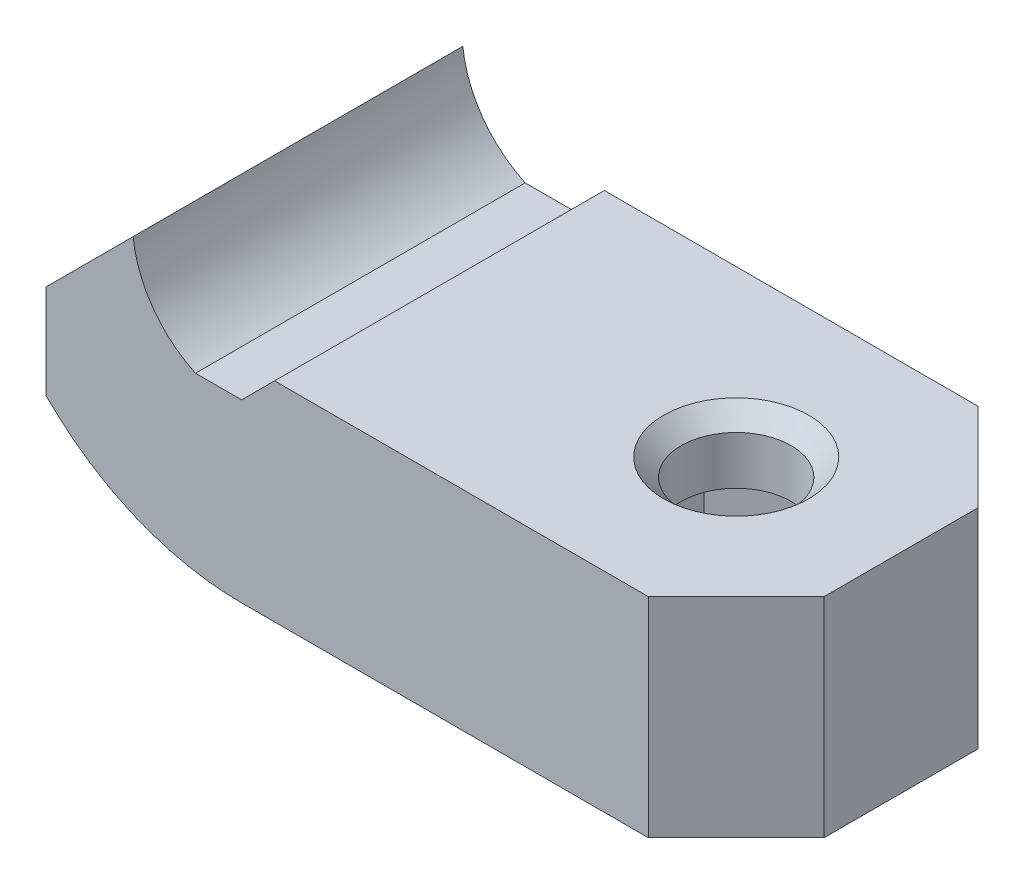
ISO-10303-21;
HEADER;
FILE_DESCRIPTION(('STEP AP214'),'2;1');
FILE_NAME('part.step','',(''),(''),'','','');
FILE_SCHEMA(('AUTOMOTIVE_DESIGN { 1 0 10303 214 1 1 1 1 }'));
ENDSEC;
DATA;
#1=APPLICATION_CONTEXT('core data for automotive mechanical design processes');
#2=APPLICATION_PROTOCOL_DEFINITION('international standard','automotive_design',2000,#1);
#3=PRODUCT_CONTEXT('',#1,'mechanical');
#4=PRODUCT('Part','Part','',(#3));
#5=PRODUCT_RELATED_PRODUCT_CATEGORY('part','',(#4));
#6=PRODUCT_DEFINITION_FORMATION('','',#4);
#7=PRODUCT_DEFINITION_CONTEXT('part definition',#1,'design');
#8=PRODUCT_DEFINITION('design','',#6,#7);
#9=PRODUCT_DEFINITION_SHAPE('','',#8);
#10=(LENGTH_UNIT() NAMED_UNIT(*) SI_UNIT(.MILLI.,.METRE.));
#11=(NAMED_UNIT(*) PLANE_ANGLE_UNIT() SI_UNIT($,.RADIAN.));
#12=(NAMED_UNIT(*) SI_UNIT($,.STERADIAN.) SOLID_ANGLE_UNIT());
#13=UNCERTAINTY_MEASURE_WITH_UNIT(LENGTH_MEASURE(1.E-05),#10,'distance_accuracy_value','');
#14=(GEOMETRIC_REPRESENTATION_CONTEXT(3) GLOBAL_UNCERTAINTY_ASSIGNED_CONTEXT((#13)) GLOBAL_UNIT_ASSIGNED_CONTEXT((#10,
#11,#12)) REPRESENTATION_CONTEXT('',''));
#15=CARTESIAN_POINT('',(0.,0.,0.));
#16=DIRECTION('',(0.,0.,1.));
#17=DIRECTION('',(1.,0.,0.));
#18=AXIS2_PLACEMENT_3D('',#15,#16,#17);
#19=CARTESIAN_POINT('',(-2.1,4.,7.5));
#20=DIRECTION('',(0.,-1.,0.));
#21=DIRECTION('',(1.,0.,0.));
#22=AXIS2_PLACEMENT_3D('',#19,#20,#21);
#23=PLANE('',#22);
#24=DIRECTION('',(-1.,0.,0.));
#25=VECTOR('',#24,1.);
#26=CARTESIAN_POINT('',(-2.1,4.,-7.5));
#27=LINE('',#26,#25);
#28=CARTESIAN_POINT('',(0.,4.,-7.5));
#29=VERTEX_POINT('',#28);
#30=CARTESIAN_POINT('',(-2.1,4.,-7.5));
#31=VERTEX_POINT('',#30);
#32=EDGE_CURVE('E234',#29,#31,#27,.T.);
#33=ORIENTED_EDGE('',*,*,#32,.T.);
#34=DIRECTION('',(0.,0.,-1.));
#35=VECTOR('',#34,1.);
#36=CARTESIAN_POINT('',(-2.1,4.,7.5));
#37=LINE('',#36,#35);
#38=CARTESIAN_POINT('',(-2.1,4.,7.5));
#39=VERTEX_POINT('',#38);
#40=EDGE_CURVE('E272',#39,#31,#37,.T.);
#41=ORIENTED_EDGE('',*,*,#40,.F.);
#42=DIRECTION('',(-1.,0.,0.));
#43=VECTOR('',#42,1.);
#44=CARTESIAN_POINT('',(-2.1,4.,7.5));
#45=LINE('',#44,#43);
#46=CARTESIAN_POINT('',(0.,4.,7.5));
#47=VERTEX_POINT('',#46);
#48=EDGE_CURVE('E239',#47,#39,#45,.T.);
#49=ORIENTED_EDGE('',*,*,#48,.F.);
#50=DIRECTION('',(0.,0.,-1.));
#51=VECTOR('',#50,1.);
#52=CARTESIAN_POINT('',(0.,4.,7.5));
#53=LINE('',#52,#51);
#54=EDGE_CURVE('E275',#47,#29,#53,.T.);
#55=ORIENTED_EDGE('',*,*,#54,.T.);
#56=EDGE_LOOP('',(#33,#41,#49,#55));
#57=FACE_BOUND('',#56,.T.);
#58=ADVANCED_FACE('F35',(#57),#23,.F.);
#59=CARTESIAN_POINT('',(0.,8.5,7.5));
#60=DIRECTION('',(0.,0.,-1.));
#61=DIRECTION('',(-1.,0.,0.));
#62=AXIS2_PLACEMENT_3D('',#59,#60,#61);
#63=CYLINDRICAL_SURFACE('',#62,4.96588360717405);
#64=CARTESIAN_POINT('',(0.,8.5,-7.5));
#65=DIRECTION('',(0.,0.,-1.));
#66=DIRECTION('',(-1.,0.,0.));
#67=AXIS2_PLACEMENT_3D('',#64,#65,#66);
#68=CIRCLE('',#67,4.96588360717405);
#69=CARTESIAN_POINT('',(-4.9367864366808,7.9632135633192,-7.5));
#70=VERTEX_POINT('',#69);
#71=EDGE_CURVE('E253',#31,#70,#68,.T.);
#72=ORIENTED_EDGE('',*,*,#71,.T.);
#73=DIRECTION('',(0.,0.,-1.));
#74=VECTOR('',#73,1.);
#75=CARTESIAN_POINT('',(-4.9367864366808,7.9632135633192,7.5));
#76=LINE('',#75,#74);
#77=CARTESIAN_POINT('',(-4.9367864366808,7.9632135633192,7.5));
#78=VERTEX_POINT('',#77);
#79=EDGE_CURVE('E269',#78,#70,#76,.T.);
#80=ORIENTED_EDGE('',*,*,#79,.F.);
#81=CARTESIAN_POINT('',(0.,8.5,7.5));
#82=DIRECTION('',(0.,0.,-1.));
#83=DIRECTION('',(-1.,0.,0.));
#84=AXIS2_PLACEMENT_3D('',#81,#82,#83);
#85=CIRCLE('',#84,4.96588360717405);
#86=EDGE_CURVE('E241',#39,#78,#85,.T.);
#87=ORIENTED_EDGE('',*,*,#86,.F.);
#88=ORIENTED_EDGE('',*,*,#40,.T.);
#89=EDGE_LOOP('',(#72,#80,#87,#88));
#90=FACE_BOUND('',#89,.T.);
#91=ADVANCED_FACE('F388',(#90),#63,.F.);
#92=CARTESIAN_POINT('',(-8.9,4.,7.5));
#93=DIRECTION('',(0.707106781186547,-0.707106781186548,0.));
#94=DIRECTION('',(0.707106781186548,0.707106781186547,0.));
#95=AXIS2_PLACEMENT_3D('',#92,#93,#94);
#96=PLANE('',#95);
#97=DIRECTION('',(-0.707106781186548,-0.707106781186547,0.));
#98=VECTOR('',#97,1.);
#99=CARTESIAN_POINT('',(-8.9,4.,-7.5));
#100=LINE('',#99,#98);
#101=CARTESIAN_POINT('',(-8.9,4.,-7.5));
#102=VERTEX_POINT('',#101);
#103=EDGE_CURVE('E255',#70,#102,#100,.T.);
#104=ORIENTED_EDGE('',*,*,#103,.T.);
#105=DIRECTION('',(0.,0.,-1.));
#106=VECTOR('',#105,1.);
#107=CARTESIAN_POINT('',(-8.9,4.,7.5));
#108=LINE('',#107,#106);
#109=CARTESIAN_POINT('',(-8.9,4.,7.5));
#110=VERTEX_POINT('',#109);
#111=EDGE_CURVE('E266',#110,#102,#108,.T.);
#112=ORIENTED_EDGE('',*,*,#111,.F.);
#113=DIRECTION('',(-0.707106781186548,-0.707106781186547,0.));
#114=VECTOR('',#113,1.);
#115=CARTESIAN_POINT('',(-8.9,4.,7.5));
#116=LINE('',#115,#114);
#117=EDGE_CURVE('E244',#78,#110,#116,.T.);
#118=ORIENTED_EDGE('',*,*,#117,.F.);
#119=ORIENTED_EDGE('',*,*,#79,.T.);
#120=EDGE_LOOP('',(#104,#112,#118,#119));
#121=FACE_BOUND('',#120,.T.);
#122=ADVANCED_FACE('F394',(#121),#96,.F.);
#123=CARTESIAN_POINT('',(-8.9,4.,7.5));
#124=DIRECTION('',(1.,0.,0.));
#125=DIRECTION('',(0.,1.,0.));
#126=AXIS2_PLACEMENT_3D('',#123,#124,#125);
#127=PLANE('',#126);
#128=DIRECTION('',(0.,-1.,0.));
#129=VECTOR('',#128,1.);
#130=CARTESIAN_POINT('',(-8.9,4.,-7.5));
#131=LINE('',#130,#129);
#132=CARTESIAN_POINT('',(-8.9,-0.277243302996677,-7.5));
#133=VERTEX_POINT('',#132);
#134=EDGE_CURVE('E257',#102,#133,#131,.T.);
#135=ORIENTED_EDGE('',*,*,#134,.T.);
#136=DIRECTION('',(0.,0.,-1.));
#137=VECTOR('',#136,1.);
#138=CARTESIAN_POINT('',(-8.9,-0.277243302996677,7.5));
#139=LINE('',#138,#137);
#140=CARTESIAN_POINT('',(-8.9,-0.277243302996677,7.5));
#141=VERTEX_POINT('',#140);
#142=EDGE_CURVE('E263',#141,#133,#139,.T.);
#143=ORIENTED_EDGE('',*,*,#142,.F.);
#144=DIRECTION('',(0.,-1.,0.));
#145=VECTOR('',#144,1.);
#146=CARTESIAN_POINT('',(-8.9,4.,7.5));
#147=LINE('',#146,#145);
#148=EDGE_CURVE('E246',#110,#141,#147,.T.);
#149=ORIENTED_EDGE('',*,*,#148,.F.);
#150=ORIENTED_EDGE('',*,*,#111,.T.);
#151=EDGE_LOOP('',(#135,#143,#149,#150));
#152=FACE_BOUND('',#151,.T.);
#153=ADVANCED_FACE('F628',(#152),#127,.F.);
#154=CARTESIAN_POINT('',(0.,8.5,7.5));
#155=DIRECTION('',(0.,0.,-1.));
#156=DIRECTION('',(-1.,0.,0.));
#157=AXIS2_PLACEMENT_3D('',#154,#155,#156);
#158=CYLINDRICAL_SURFACE('',#157,12.5);
#159=CARTESIAN_POINT('',(0.,8.5,-7.5));
#160=DIRECTION('',(0.,0.,1.));
#161=DIRECTION('',(-1.,0.,0.));
#162=AXIS2_PLACEMENT_3D('',#159,#160,#161);
#163=CIRCLE('',#162,12.5);
#164=CARTESIAN_POINT('',(0.,-4.,-7.5));
#165=VERTEX_POINT('',#164);
#166=EDGE_CURVE('E242',#133,#165,#163,.T.);
#167=ORIENTED_EDGE('',*,*,#166,.T.);
#168=DIRECTION('',(0.,0.,-1.));
#169=VECTOR('',#168,1.);
#170=CARTESIAN_POINT('',(0.,-4.,7.5));
#171=LINE('',#170,#169);
#172=CARTESIAN_POINT('',(0.,-4.,7.5));
#173=VERTEX_POINT('',#172);
#174=EDGE_CURVE('E251',#173,#165,#171,.T.);
#175=ORIENTED_EDGE('',*,*,#174,.F.);
#176=CARTESIAN_POINT('',(0.,8.5,7.5));
#177=DIRECTION('',(0.,0.,1.));
#178=DIRECTION('',(-1.,0.,0.));
#179=AXIS2_PLACEMENT_3D('',#176,#177,#178);
#180=CIRCLE('',#179,12.5);
#181=EDGE_CURVE('E248',#141,#173,#180,.T.);
#182=ORIENTED_EDGE('',*,*,#181,.F.);
#183=ORIENTED_EDGE('',*,*,#142,.T.);
#184=EDGE_LOOP('',(#167,#175,#182,#183));
#185=FACE_BOUND('',#184,.T.);
#186=ADVANCED_FACE('F600',(#185),#158,.T.);
#187=CARTESIAN_POINT('',(0.,8.5,7.5));
#188=DIRECTION('',(0.,0.,-1.));
#189=DIRECTION('',(-1.,0.,0.));
#190=AXIS2_PLACEMENT_3D('',#187,#188,#189);
#191=PLANE('',#190);
#192=DIRECTION('',(-1.,0.,0.));
#193=VECTOR('',#192,1.);
#194=CARTESIAN_POINT('',(22.5,-4.,7.5));
#195=LINE('',#194,#193);
#196=CARTESIAN_POINT('',(18.5,-4.,7.5));
#197=VERTEX_POINT('',#196);
#198=EDGE_CURVE('E221',#197,#173,#195,.T.);
#199=ORIENTED_EDGE('',*,*,#198,.F.);
#200=DIRECTION('',(0.,1.,0.));
#201=VECTOR('',#200,1.);
#202=CARTESIAN_POINT('',(18.5,5.5,7.5));
#203=LINE('',#202,#201);
#204=CARTESIAN_POINT('',(18.5,5.49999999999707,7.5));
#205=VERTEX_POINT('',#204);
#206=EDGE_CURVE('E296',#197,#205,#203,.T.);
#207=ORIENTED_EDGE('',*,*,#206,.T.);
#208=DIRECTION('',(1.,7.32466336260718E-13,0.));
#209=VECTOR('',#208,1.);
#210=CARTESIAN_POINT('',(1.49999999998461,5.49999999998461,7.5));
#211=LINE('',#210,#209);
#212=CARTESIAN_POINT('',(1.49999999998461,5.49999999998461,7.5));
#213=VERTEX_POINT('',#212);
#214=EDGE_CURVE('E217',#213,#205,#211,.T.);
#215=ORIENTED_EDGE('',*,*,#214,.F.);
#216=DIRECTION('',(0.707106781186547,0.707106781186549,0.));
#217=VECTOR('',#216,1.);
#218=CARTESIAN_POINT('',(0.,4.,7.5));
#219=LINE('',#218,#217);
#220=EDGE_CURVE('E214',#47,#213,#219,.T.);
#221=ORIENTED_EDGE('',*,*,#220,.F.);
#222=ORIENTED_EDGE('',*,*,#48,.T.);
#223=ORIENTED_EDGE('',*,*,#86,.T.);
#224=ORIENTED_EDGE('',*,*,#117,.T.);
#225=ORIENTED_EDGE('',*,*,#148,.T.);
#226=ORIENTED_EDGE('',*,*,#181,.T.);
#227=EDGE_LOOP('',(#199,#207,#215,#221,#222,#223,#224,#225,#226));
#228=FACE_BOUND('',#227,.T.);
#229=ADVANCED_FACE('F590',(#228),#191,.F.);
#230=CARTESIAN_POINT('',(0.,8.5,-7.5));
#231=DIRECTION('',(0.,0.,-1.));
#232=DIRECTION('',(-1.,0.,0.));
#233=AXIS2_PLACEMENT_3D('',#230,#231,#232);
#234=PLANE('',#233);
#235=DIRECTION('',(1.,7.32466336260718E-13,0.));
#236=VECTOR('',#235,1.);
#237=CARTESIAN_POINT('',(1.49999999998461,5.49999999998461,-7.5));
#238=LINE('',#237,#236);
#239=CARTESIAN_POINT('',(1.49999999998461,5.49999999998461,-7.5));
#240=VERTEX_POINT('',#239);
#241=CARTESIAN_POINT('',(18.5,5.49999999999707,-7.5));
#242=VERTEX_POINT('',#241);
#243=EDGE_CURVE('E227',#240,#242,#238,.T.);
#244=ORIENTED_EDGE('',*,*,#243,.T.);
#245=DIRECTION('',(0.,-1.,0.));
#246=VECTOR('',#245,1.);
#247=CARTESIAN_POINT('',(18.5,8.5,-7.5));
#248=LINE('',#247,#246);
#249=CARTESIAN_POINT('',(18.5,-4.,-7.5));
#250=VERTEX_POINT('',#249);
#251=EDGE_CURVE('E278',#242,#250,#248,.T.);
#252=ORIENTED_EDGE('',*,*,#251,.T.);
#253=DIRECTION('',(-1.,0.,0.));
#254=VECTOR('',#253,1.);
#255=CARTESIAN_POINT('',(22.5,-4.,-7.5));
#256=LINE('',#255,#254);
#257=EDGE_CURVE('E218',#250,#165,#256,.T.);
#258=ORIENTED_EDGE('',*,*,#257,.T.);
#259=ORIENTED_EDGE('',*,*,#166,.F.);
#260=ORIENTED_EDGE('',*,*,#134,.F.);
#261=ORIENTED_EDGE('',*,*,#103,.F.);
#262=ORIENTED_EDGE('',*,*,#71,.F.);
#263=ORIENTED_EDGE('',*,*,#32,.F.);
#264=DIRECTION('',(0.707106781186547,0.707106781186549,0.));
#265=VECTOR('',#264,1.);
#266=CARTESIAN_POINT('',(0.,4.,-7.5));
#267=LINE('',#266,#265);
#268=EDGE_CURVE('E224',#29,#240,#267,.T.);
#269=ORIENTED_EDGE('',*,*,#268,.T.);
#270=EDGE_LOOP('',(#244,#252,#258,#259,#260,#261,#262,#263,#269));
#271=FACE_BOUND('',#270,.T.);
#272=ADVANCED_FACE('F582',(#271),#234,.T.);
#273=CARTESIAN_POINT('',(22.5,-4.,7.5));
#274=DIRECTION('',(0.,-1.,0.));
#275=DIRECTION('',(1.,0.,0.));
#276=AXIS2_PLACEMENT_3D('',#273,#274,#275);
#277=PLANE('',#276);
#278=DIRECTION('',(-0.866025403784439,0.,0.5));
#279=VECTOR('',#278,1.);
#280=CARTESIAN_POINT('',(11.149999999996,-4.,-2.68467875173176));
#281=LINE('',#280,#279);
#282=CARTESIAN_POINT('',(14.999999999996,-4.,-4.90747728811182));
#283=VERTEX_POINT('',#282);
#284=CARTESIAN_POINT('',(10.749999999996,-4.,-2.45373864405591));
#285=VERTEX_POINT('',#284);
#286=EDGE_CURVE('E307',#283,#285,#281,.T.);
#287=ORIENTED_EDGE('',*,*,#286,.T.);
#288=DIRECTION('',(0.,0.,1.));
#289=VECTOR('',#288,1.);
#290=CARTESIAN_POINT('',(10.749999999996,-4.,1.99185842870421));
#291=LINE('',#290,#289);
#292=CARTESIAN_POINT('',(10.749999999996,-4.,2.45373864405591));
#293=VERTEX_POINT('',#292);
#294=EDGE_CURVE('E317',#285,#293,#291,.T.);
#295=ORIENTED_EDGE('',*,*,#294,.T.);
#296=DIRECTION('',(0.866025403784439,0.,0.5));
#297=VECTOR('',#296,1.);
#298=CARTESIAN_POINT('',(14.599999999996,-4.,4.67653718043597));
#299=LINE('',#298,#297);
#300=CARTESIAN_POINT('',(14.999999999996,-4.,4.90747728811183));
#301=VERTEX_POINT('',#300);
#302=EDGE_CURVE('E315',#293,#301,#299,.T.);
#303=ORIENTED_EDGE('',*,*,#302,.T.);
#304=DIRECTION('',(0.866025403784439,0.,-0.5));
#305=VECTOR('',#304,1.);
#306=CARTESIAN_POINT('',(18.849999999996,-4.,2.68467875173176));
#307=LINE('',#306,#305);
#308=CARTESIAN_POINT('',(19.249999999996,-4.,2.45373864405591));
#309=VERTEX_POINT('',#308);
#310=EDGE_CURVE('E313',#301,#309,#307,.T.);
#311=ORIENTED_EDGE('',*,*,#310,.T.);
#312=DIRECTION('',(0.,0.,-1.));
#313=VECTOR('',#312,1.);
#314=CARTESIAN_POINT('',(19.249999999996,-4.,-1.99185842870421));
#315=LINE('',#314,#313);
#316=CARTESIAN_POINT('',(19.249999999996,-4.,-2.45373864405591));
#317=VERTEX_POINT('',#316);
#318=EDGE_CURVE('E311',#309,#317,#315,.T.);
#319=ORIENTED_EDGE('',*,*,#318,.T.);
#320=DIRECTION('',(-0.866025403784439,0.,-0.5));
#321=VECTOR('',#320,1.);
#322=CARTESIAN_POINT('',(15.399999999996,-4.,-4.67653718043597));
#323=LINE('',#322,#321);
#324=EDGE_CURVE('E309',#317,#283,#323,.T.);
#325=ORIENTED_EDGE('',*,*,#324,.T.);
#326=EDGE_LOOP('',(#287,#295,#303,#311,#319,#325));
#327=FACE_BOUND('',#326,.T.);
#328=ORIENTED_EDGE('',*,*,#257,.F.);
#329=DIRECTION('',(-0.707106781186546,0.,-0.707106781186549));
#330=VECTOR('',#329,1.);
#331=CARTESIAN_POINT('',(28.,-4.,2.00000000000002));
#332=LINE('',#331,#330);
#333=CARTESIAN_POINT('',(22.5,-4.,-3.49999999999999));
#334=VERTEX_POINT('',#333);
#335=EDGE_CURVE('E285',#250,#334,#332,.F.);
#336=ORIENTED_EDGE('',*,*,#335,.T.);
#337=DIRECTION('',(0.,0.,-1.));
#338=VECTOR('',#337,1.);
#339=CARTESIAN_POINT('',(22.5,-4.,7.5));
#340=LINE('',#339,#338);
#341=CARTESIAN_POINT('',(22.5,-4.,3.5));
#342=VERTEX_POINT('',#341);
#343=EDGE_CURVE('E231',#342,#334,#340,.T.);
#344=ORIENTED_EDGE('',*,*,#343,.F.);
#345=DIRECTION('',(-0.707106781186549,0.,0.707106781186546));
#346=VECTOR('',#345,1.);
#347=CARTESIAN_POINT('',(20.5,-4.,5.49999999999999));
#348=LINE('',#347,#346);
#349=EDGE_CURVE('E283',#342,#197,#348,.T.);
#350=ORIENTED_EDGE('',*,*,#349,.T.);
#351=ORIENTED_EDGE('',*,*,#198,.T.);
#352=ORIENTED_EDGE('',*,*,#174,.T.);
#353=EDGE_LOOP('',(#328,#336,#344,#350,#351,#352));
#354=FACE_BOUND('',#353,.T.);
#355=ADVANCED_FACE('F374',(#327,#354),#277,.T.);
#356=CARTESIAN_POINT('',(22.5,5.5,7.5));
#357=DIRECTION('',(1.,0.,0.));
#358=DIRECTION('',(0.,0.,-1.));
#359=AXIS2_PLACEMENT_3D('',#356,#357,#358);
#360=PLANE('',#359);
#361=ORIENTED_EDGE('',*,*,#343,.T.);
#362=DIRECTION('',(0.,1.,0.));
#363=VECTOR('',#362,1.);
#364=CARTESIAN_POINT('',(22.5,5.5,-3.49999999999999));
#365=LINE('',#364,#363);
#366=CARTESIAN_POINT('',(22.5,5.5,-3.49999999999999));
#367=VERTEX_POINT('',#366);
#368=EDGE_CURVE('E290',#334,#367,#365,.T.);
#369=ORIENTED_EDGE('',*,*,#368,.T.);
#370=DIRECTION('',(0.,0.,-1.));
#371=VECTOR('',#370,1.);
#372=CARTESIAN_POINT('',(22.5,5.5,7.5));
#373=LINE('',#372,#371);
#374=CARTESIAN_POINT('',(22.5,5.5,3.5));
#375=VERTEX_POINT('',#374);
#376=EDGE_CURVE('E235',#375,#367,#373,.T.);
#377=ORIENTED_EDGE('',*,*,#376,.F.);
#378=DIRECTION('',(0.,-1.,0.));
#379=VECTOR('',#378,1.);
#380=CARTESIAN_POINT('',(22.5,-4.,3.5));
#381=LINE('',#380,#379);
#382=EDGE_CURVE('E287',#375,#342,#381,.T.);
#383=ORIENTED_EDGE('',*,*,#382,.T.);
#384=EDGE_LOOP('',(#361,#369,#377,#383));
#385=FACE_BOUND('',#384,.T.);
#386=ADVANCED_FACE('F566',(#385),#360,.T.);
#387=CARTESIAN_POINT('',(1.49999999998461,5.49999999998461,7.5));
#388=DIRECTION('',(-7.32466336260718E-13,1.,0.));
#389=DIRECTION('',(-1.,-7.32466336260718E-13,0.));
#390=AXIS2_PLACEMENT_3D('',#387,#388,#389);
#391=PLANE('',#390);
#392=CARTESIAN_POINT('',(14.999999999996,5.4999999999945,0.));
#393=DIRECTION('',(-7.32466336260718E-13,1.,0.));
#394=DIRECTION('',(-1.,-7.32466336260718E-13,0.));
#395=AXIS2_PLACEMENT_3D('',#392,#393,#394);
#396=CIRCLE('',#395,3.30000000000557);
#397=CARTESIAN_POINT('',(11.6999999999904,5.49999999999209,0.));
#398=VERTEX_POINT('',#397);
#399=EDGE_CURVE('E301',#398,#398,#396,.F.);
#400=ORIENTED_EDGE('',*,*,#399,.T.);
#401=EDGE_LOOP('',(#400));
#402=FACE_BOUND('',#401,.T.);
#403=ORIENTED_EDGE('',*,*,#376,.T.);
#404=DIRECTION('',(0.707106781186546,5.17931913360819E-13,0.707106781186549));
#405=VECTOR('',#404,1.);
#406=CARTESIAN_POINT('',(17.4999999999923,5.49999999999634,-8.50000000000767));
#407=LINE('',#406,#405);
#408=EDGE_CURVE('E294',#367,#242,#407,.F.);
#409=ORIENTED_EDGE('',*,*,#408,.T.);
#410=ORIENTED_EDGE('',*,*,#243,.F.);
#411=DIRECTION('',(0.,0.,-1.));
#412=VECTOR('',#411,1.);
#413=CARTESIAN_POINT('',(1.49999999998461,5.49999999998461,7.5));
#414=LINE('',#413,#412);
#415=EDGE_CURVE('E223',#213,#240,#414,.T.);
#416=ORIENTED_EDGE('',*,*,#415,.F.);
#417=ORIENTED_EDGE('',*,*,#214,.T.);
#418=DIRECTION('',(0.707106781186549,5.17931913360821E-13,-0.707106781186546));
#419=VECTOR('',#418,1.);
#420=CARTESIAN_POINT('',(9.99999999999227,5.49999999999084,16.0000000000077));
#421=LINE('',#420,#419);
#422=EDGE_CURVE('E292',#205,#375,#421,.T.);
#423=ORIENTED_EDGE('',*,*,#422,.T.);
#424=EDGE_LOOP('',(#403,#409,#410,#416,#417,#423));
#425=FACE_BOUND('',#424,.T.);
#426=ADVANCED_FACE('F557',(#402,#425),#391,.T.);
#427=CARTESIAN_POINT('',(0.,4.,7.5));
#428=DIRECTION('',(-0.707106781186549,0.707106781186547,0.));
#429=DIRECTION('',(-0.707106781186547,-0.707106781186549,0.));
#430=AXIS2_PLACEMENT_3D('',#427,#428,#429);
#431=PLANE('',#430);
#432=ORIENTED_EDGE('',*,*,#268,.F.);
#433=ORIENTED_EDGE('',*,*,#54,.F.);
#434=ORIENTED_EDGE('',*,*,#220,.T.);
#435=ORIENTED_EDGE('',*,*,#415,.T.);
#436=EDGE_LOOP('',(#432,#433,#434,#435));
#437=FACE_BOUND('',#436,.T.);
#438=ADVANCED_FACE('F548',(#437),#431,.T.);
#439=CARTESIAN_POINT('',(14.999999999996,-4.,0.));
#440=DIRECTION('',(0.,1.,0.));
#441=DIRECTION('',(-1.,0.,0.));
#442=AXIS2_PLACEMENT_3D('',#439,#440,#441);
#443=CYLINDRICAL_SURFACE('',#442,2.5);
#444=CARTESIAN_POINT('',(14.999999999996,4.69999999998711,0.));
#445=DIRECTION('',(0.,1.,0.));
#446=DIRECTION('',(0.,0.,1.));
#447=AXIS2_PLACEMENT_3D('',#444,#445,#446);
#448=CIRCLE('',#447,2.5);
#449=CARTESIAN_POINT('',(14.999999999996,4.69999999998711,2.5));
#450=VERTEX_POINT('',#449);
#451=EDGE_CURVE('E298',#450,#450,#448,.T.);
#452=ORIENTED_EDGE('',*,*,#451,.T.);
#453=EDGE_LOOP('',(#452));
#454=FACE_BOUND('',#453,.T.);
#455=CARTESIAN_POINT('',(14.999999999996,2.49999999998351,0.));
#456=DIRECTION('',(0.,1.,0.));
#457=DIRECTION('',(0.,0.,1.));
#458=AXIS2_PLACEMENT_3D('',#455,#456,#457);
#459=CIRCLE('',#458,2.5);
#460=CARTESIAN_POINT('',(14.999999999996,2.49999999998351,2.5));
#461=VERTEX_POINT('',#460);
#462=EDGE_CURVE('E206',#461,#461,#459,.F.);
#463=ORIENTED_EDGE('',*,*,#462,.T.);
#464=EDGE_LOOP('',(#463));
#465=FACE_BOUND('',#464,.T.);
#466=ADVANCED_FACE('F539',(#454,#465),#443,.F.);
#467=CARTESIAN_POINT('',(0.,2.49999999998352,0.));
#468=DIRECTION('',(0.,1.,0.));
#469=DIRECTION('',(0.,0.,1.));
#470=AXIS2_PLACEMENT_3D('',#467,#468,#469);
#471=PLANE('',#470);
#472=DIRECTION('',(-0.866025403784438,0.,-0.5));
#473=VECTOR('',#472,1.);
#474=CARTESIAN_POINT('',(18.449999999996,2.49999999998351,-1.99185842870421));
#475=LINE('',#474,#473);
#476=CARTESIAN_POINT('',(18.449999999996,2.49999999998351,-1.99185842870421));
#477=VERTEX_POINT('',#476);
#478=CARTESIAN_POINT('',(14.999999999996,2.49999999998351,-3.98371685740842));
#479=VERTEX_POINT('',#478);
#480=EDGE_CURVE('E185',#477,#479,#475,.T.);
#481=ORIENTED_EDGE('',*,*,#480,.F.);
#482=DIRECTION('',(0.,0.,-1.));
#483=VECTOR('',#482,1.);
#484=CARTESIAN_POINT('',(18.449999999996,2.49999999998351,1.99185842870421));
#485=LINE('',#484,#483);
#486=CARTESIAN_POINT('',(18.449999999996,2.49999999998351,1.99185842870421));
#487=VERTEX_POINT('',#486);
#488=EDGE_CURVE('E177',#487,#477,#485,.T.);
#489=ORIENTED_EDGE('',*,*,#488,.F.);
#490=DIRECTION('',(0.866025403784439,0.,-0.5));
#491=VECTOR('',#490,1.);
#492=CARTESIAN_POINT('',(14.999999999996,2.49999999998351,3.98371685740842));
#493=LINE('',#492,#491);
#494=CARTESIAN_POINT('',(14.999999999996,2.49999999998351,3.98371685740842));
#495=VERTEX_POINT('',#494);
#496=EDGE_CURVE('E201',#495,#487,#493,.T.);
#497=ORIENTED_EDGE('',*,*,#496,.F.);
#498=DIRECTION('',(0.866025403784439,0.,0.5));
#499=VECTOR('',#498,1.);
#500=CARTESIAN_POINT('',(11.549999999996,2.49999999998351,1.99185842870421));
#501=LINE('',#500,#499);
#502=CARTESIAN_POINT('',(11.549999999996,2.49999999998351,1.99185842870421));
#503=VERTEX_POINT('',#502);
#504=EDGE_CURVE('E198',#503,#495,#501,.T.);
#505=ORIENTED_EDGE('',*,*,#504,.F.);
#506=DIRECTION('',(0.,0.,1.));
#507=VECTOR('',#506,1.);
#508=CARTESIAN_POINT('',(11.549999999996,2.49999999998351,-1.99185842870421));
#509=LINE('',#508,#507);
#510=CARTESIAN_POINT('',(11.549999999996,2.49999999998351,-1.99185842870421));
#511=VERTEX_POINT('',#510);
#512=EDGE_CURVE('E189',#511,#503,#509,.T.);
#513=ORIENTED_EDGE('',*,*,#512,.F.);
#514=DIRECTION('',(-0.866025403784439,0.,0.5));
#515=VECTOR('',#514,1.);
#516=CARTESIAN_POINT('',(14.999999999996,2.49999999998351,-3.98371685740842));
#517=LINE('',#516,#515);
#518=EDGE_CURVE('E174',#479,#511,#517,.T.);
#519=ORIENTED_EDGE('',*,*,#518,.F.);
#520=EDGE_LOOP('',(#481,#489,#497,#505,#513,#519));
#521=FACE_BOUND('',#520,.T.);
#522=ORIENTED_EDGE('',*,*,#462,.F.);
#523=EDGE_LOOP('',(#522));
#524=FACE_BOUND('',#523,.T.);
#525=ADVANCED_FACE('F182',(#521,#524),#471,.F.);
#526=CARTESIAN_POINT('',(18.449999999996,-7.50000000001649,-1.99185842870421));
#527=DIRECTION('',(0.5,0.,-0.866025403784438));
#528=DIRECTION('',(-0.866025403784438,0.,-0.5));
#529=AXIS2_PLACEMENT_3D('',#526,#527,#528);
#530=PLANE('',#529);
#531=DIRECTION('',(0.,1.,0.));
#532=VECTOR('',#531,1.);
#533=CARTESIAN_POINT('',(14.999999999996,-7.50000000001649,-3.98371685740842));
#534=LINE('',#533,#532);
#535=CARTESIAN_POINT('',(14.999999999996,-3.2,-3.98371685740842));
#536=VERTEX_POINT('',#535);
#537=EDGE_CURVE('E171',#536,#479,#534,.T.);
#538=ORIENTED_EDGE('',*,*,#537,.F.);
#539=DIRECTION('',(0.866025403784438,0.,0.5));
#540=VECTOR('',#539,1.);
#541=CARTESIAN_POINT('',(18.449999999996,-3.2,-1.99185842870421));
#542=LINE('',#541,#540);
#543=CARTESIAN_POINT('',(18.449999999996,-3.2,-1.99185842870421));
#544=VERTEX_POINT('',#543);
#545=EDGE_CURVE('E45',#536,#544,#542,.T.);
#546=ORIENTED_EDGE('',*,*,#545,.T.);
#547=DIRECTION('',(0.,1.,0.));
#548=VECTOR('',#547,1.);
#549=CARTESIAN_POINT('',(18.449999999996,-7.50000000001649,-1.99185842870421));
#550=LINE('',#549,#548);
#551=EDGE_CURVE('E192',#544,#477,#550,.T.);
#552=ORIENTED_EDGE('',*,*,#551,.T.);
#553=ORIENTED_EDGE('',*,*,#480,.T.);
#554=EDGE_LOOP('',(#538,#546,#552,#553));
#555=FACE_BOUND('',#554,.T.);
#556=ADVANCED_FACE('F191',(#555),#530,.F.);
#557=CARTESIAN_POINT('',(18.449999999996,-7.50000000001649,1.99185842870421));
#558=DIRECTION('',(1.,0.,0.));
#559=DIRECTION('',(0.,0.,-1.));
#560=AXIS2_PLACEMENT_3D('',#557,#558,#559);
#561=PLANE('',#560);
#562=ORIENTED_EDGE('',*,*,#551,.F.);
#563=DIRECTION('',(0.,0.,1.));
#564=VECTOR('',#563,1.);
#565=CARTESIAN_POINT('',(18.449999999996,-3.2,1.99185842870421));
#566=LINE('',#565,#564);
#567=CARTESIAN_POINT('',(18.449999999996,-3.2,1.99185842870421));
#568=VERTEX_POINT('',#567);
#569=EDGE_CURVE('E324',#544,#568,#566,.T.);
#570=ORIENTED_EDGE('',*,*,#569,.T.);
#571=DIRECTION('',(0.,1.,0.));
#572=VECTOR('',#571,1.);
#573=CARTESIAN_POINT('',(18.449999999996,-7.50000000001649,1.99185842870421));
#574=LINE('',#573,#572);
#575=EDGE_CURVE('E207',#568,#487,#574,.T.);
#576=ORIENTED_EDGE('',*,*,#575,.T.);
#577=ORIENTED_EDGE('',*,*,#488,.T.);
#578=EDGE_LOOP('',(#562,#570,#576,#577));
#579=FACE_BOUND('',#578,.T.);
#580=ADVANCED_FACE('F349',(#579),#561,.F.);
#581=CARTESIAN_POINT('',(14.999999999996,-7.50000000001649,3.98371685740842));
#582=DIRECTION('',(0.5,0.,0.866025403784439));
#583=DIRECTION('',(0.866025403784439,0.,-0.5));
#584=AXIS2_PLACEMENT_3D('',#581,#582,#583);
#585=PLANE('',#584);
#586=ORIENTED_EDGE('',*,*,#575,.F.);
#587=DIRECTION('',(-0.866025403784439,0.,0.5));
#588=VECTOR('',#587,1.);
#589=CARTESIAN_POINT('',(14.999999999996,-3.2,3.98371685740842));
#590=LINE('',#589,#588);
#591=CARTESIAN_POINT('',(14.999999999996,-3.2,3.98371685740842));
#592=VERTEX_POINT('',#591);
#593=EDGE_CURVE('E322',#568,#592,#590,.T.);
#594=ORIENTED_EDGE('',*,*,#593,.T.);
#595=DIRECTION('',(0.,1.,0.));
#596=VECTOR('',#595,1.);
#597=CARTESIAN_POINT('',(14.999999999996,-7.50000000001649,3.98371685740842));
#598=LINE('',#597,#596);
#599=EDGE_CURVE('E209',#592,#495,#598,.T.);
#600=ORIENTED_EDGE('',*,*,#599,.T.);
#601=ORIENTED_EDGE('',*,*,#496,.T.);
#602=EDGE_LOOP('',(#586,#594,#600,#601));
#603=FACE_BOUND('',#602,.T.);
#604=ADVANCED_FACE('F351',(#603),#585,.F.);
#605=CARTESIAN_POINT('',(11.549999999996,-7.50000000001649,1.99185842870421));
#606=DIRECTION('',(-0.5,0.,0.866025403784439));
#607=DIRECTION('',(0.866025403784439,0.,0.5));
#608=AXIS2_PLACEMENT_3D('',#605,#606,#607);
#609=PLANE('',#608);
#610=ORIENTED_EDGE('',*,*,#599,.F.);
#611=DIRECTION('',(-0.866025403784439,0.,-0.5));
#612=VECTOR('',#611,1.);
#613=CARTESIAN_POINT('',(11.549999999996,-3.2,1.99185842870421));
#614=LINE('',#613,#612);
#615=CARTESIAN_POINT('',(11.549999999996,-3.2,1.99185842870421));
#616=VERTEX_POINT('',#615);
#617=EDGE_CURVE('E320',#592,#616,#614,.T.);
#618=ORIENTED_EDGE('',*,*,#617,.T.);
#619=DIRECTION('',(0.,1.,0.));
#620=VECTOR('',#619,1.);
#621=CARTESIAN_POINT('',(11.549999999996,-7.50000000001649,1.99185842870421));
#622=LINE('',#621,#620);
#623=EDGE_CURVE('E211',#616,#503,#622,.T.);
#624=ORIENTED_EDGE('',*,*,#623,.T.);
#625=ORIENTED_EDGE('',*,*,#504,.T.);
#626=EDGE_LOOP('',(#610,#618,#624,#625));
#627=FACE_BOUND('',#626,.T.);
#628=ADVANCED_FACE('F355',(#627),#609,.F.);
#629=CARTESIAN_POINT('',(11.549999999996,-7.50000000001649,-1.99185842870421));
#630=DIRECTION('',(-1.,0.,0.));
#631=DIRECTION('',(0.,0.,1.));
#632=AXIS2_PLACEMENT_3D('',#629,#630,#631);
#633=PLANE('',#632);
#634=ORIENTED_EDGE('',*,*,#623,.F.);
#635=DIRECTION('',(0.,0.,-1.));
#636=VECTOR('',#635,1.);
#637=CARTESIAN_POINT('',(11.549999999996,-3.2,-1.99185842870421));
#638=LINE('',#637,#636);
#639=CARTESIAN_POINT('',(11.549999999996,-3.2,-1.99185842870421));
#640=VERTEX_POINT('',#639);
#641=EDGE_CURVE('E304',#616,#640,#638,.T.);
#642=ORIENTED_EDGE('',*,*,#641,.T.);
#643=DIRECTION('',(0.,1.,0.));
#644=VECTOR('',#643,1.);
#645=CARTESIAN_POINT('',(11.549999999996,-7.50000000001649,-1.99185842870421));
#646=LINE('',#645,#644);
#647=EDGE_CURVE('E176',#640,#511,#646,.T.);
#648=ORIENTED_EDGE('',*,*,#647,.T.);
#649=ORIENTED_EDGE('',*,*,#512,.T.);
#650=EDGE_LOOP('',(#634,#642,#648,#649));
#651=FACE_BOUND('',#650,.T.);
#652=ADVANCED_FACE('F361',(#651),#633,.F.);
#653=CARTESIAN_POINT('',(14.999999999996,-7.50000000001649,-3.98371685740842));
#654=DIRECTION('',(-0.5,0.,-0.866025403784439));
#655=DIRECTION('',(-0.866025403784439,0.,0.5));
#656=AXIS2_PLACEMENT_3D('',#653,#654,#655);
#657=PLANE('',#656);
#658=ORIENTED_EDGE('',*,*,#647,.F.);
#659=DIRECTION('',(0.866025403784439,0.,-0.5));
#660=VECTOR('',#659,1.);
#661=CARTESIAN_POINT('',(14.999999999996,-3.2,-3.98371685740842));
#662=LINE('',#661,#660);
#663=EDGE_CURVE('E11',#640,#536,#662,.T.);
#664=ORIENTED_EDGE('',*,*,#663,.T.);
#665=ORIENTED_EDGE('',*,*,#537,.T.);
#666=ORIENTED_EDGE('',*,*,#518,.T.);
#667=EDGE_LOOP('',(#658,#664,#665,#666));
#668=FACE_BOUND('',#667,.T.);
#669=ADVANCED_FACE('F173',(#668),#657,.F.);
#670=CARTESIAN_POINT('',(18.5,8.5,-7.5));
#671=DIRECTION('',(-0.707106781186549,0.,0.707106781186546));
#672=DIRECTION('',(0.,-1.,0.));
#673=AXIS2_PLACEMENT_3D('',#670,#671,#672);
#674=PLANE('',#673);
#675=ORIENTED_EDGE('',*,*,#408,.F.);
#676=ORIENTED_EDGE('',*,*,#368,.F.);
#677=ORIENTED_EDGE('',*,*,#335,.F.);
#678=ORIENTED_EDGE('',*,*,#251,.F.);
#679=EDGE_LOOP('',(#675,#676,#677,#678));
#680=FACE_BOUND('',#679,.T.);
#681=ADVANCED_FACE('F400',(#680),#674,.F.);
#682=CARTESIAN_POINT('',(22.5,5.5,3.5));
#683=DIRECTION('',(0.707106781186546,0.,0.707106781186549));
#684=DIRECTION('',(0.,1.,0.));
#685=AXIS2_PLACEMENT_3D('',#682,#683,#684);
#686=PLANE('',#685);
#687=ORIENTED_EDGE('',*,*,#422,.F.);
#688=ORIENTED_EDGE('',*,*,#206,.F.);
#689=ORIENTED_EDGE('',*,*,#349,.F.);
#690=ORIENTED_EDGE('',*,*,#382,.F.);
#691=EDGE_LOOP('',(#687,#688,#689,#690));
#692=FACE_BOUND('',#691,.T.);
#693=ADVANCED_FACE('F406',(#692),#686,.T.);
#694=CARTESIAN_POINT('',(14.999999999996,4.6999999999871,0.));
#695=DIRECTION('',(0.,1.,0.));
#696=DIRECTION('',(0.,0.,1.));
#697=AXIS2_PLACEMENT_3D('',#694,#695,#696);
#698=CONICAL_SURFACE('',#697,2.5,0.785398163397816);
#699=ORIENTED_EDGE('',*,*,#399,.F.);
#700=EDGE_LOOP('',(#699));
#701=FACE_BOUND('',#700,.T.);
#702=ORIENTED_EDGE('',*,*,#451,.F.);
#703=EDGE_LOOP('',(#702));
#704=FACE_BOUND('',#703,.T.);
#705=ADVANCED_FACE('F385',(#701,#704),#698,.F.);
#706=CARTESIAN_POINT('',(18.449999999996,-3.2,1.99185842870421));
#707=DIRECTION('',(-0.707106781186545,-0.70710678118655,0.));
#708=DIRECTION('',(0.,0.,-1.));
#709=AXIS2_PLACEMENT_3D('',#706,#707,#708);
#710=PLANE('',#709);
#711=DIRECTION('',(-0.654653670707978,0.654653670707975,0.377964473009229));
#712=VECTOR('',#711,1.);
#713=CARTESIAN_POINT('',(17.4642857142817,-2.21428571428572,-1.422756020503));
#714=LINE('',#713,#712);
#715=EDGE_CURVE('E195',#317,#544,#714,.T.);
#716=ORIENTED_EDGE('',*,*,#715,.F.);
#717=ORIENTED_EDGE('',*,*,#318,.F.);
#718=DIRECTION('',(-0.65465367070798,0.654653670707975,-0.377964473009227));
#719=VECTOR('',#718,1.);
#720=CARTESIAN_POINT('',(17.4642857142817,-2.21428571428571,1.422756020503));
#721=LINE('',#720,#719);
#722=EDGE_CURVE('E40',#568,#309,#721,.F.);
#723=ORIENTED_EDGE('',*,*,#722,.F.);
#724=ORIENTED_EDGE('',*,*,#569,.F.);
#725=EDGE_LOOP('',(#716,#717,#723,#724));
#726=FACE_BOUND('',#725,.T.);
#727=ADVANCED_FACE('F38',(#726),#710,.T.);
#728=CARTESIAN_POINT('',(14.999999999996,-3.2,3.98371685740842));
#729=DIRECTION('',(-0.353553390593273,-0.70710678118655,-0.612372435695793));
#730=DIRECTION('',(0.866025403784439,0.,-0.5));
#731=AXIS2_PLACEMENT_3D('',#728,#729,#730);
#732=PLANE('',#731);
#733=ORIENTED_EDGE('',*,*,#722,.T.);
#734=ORIENTED_EDGE('',*,*,#310,.F.);
#735=DIRECTION('',(0.,0.654653670707975,-0.755928946018457));
#736=VECTOR('',#735,1.);
#737=CARTESIAN_POINT('',(14.999999999996,-2.21428571428572,2.84551204100601));
#738=LINE('',#737,#736);
#739=EDGE_CURVE('E334',#592,#301,#738,.F.);
#740=ORIENTED_EDGE('',*,*,#739,.F.);
#741=ORIENTED_EDGE('',*,*,#593,.F.);
#742=EDGE_LOOP('',(#733,#734,#740,#741));
#743=FACE_BOUND('',#742,.T.);
#744=ADVANCED_FACE('F378',(#743),#732,.T.);
#745=CARTESIAN_POINT('',(18.449999999996,-3.2,-1.99185842870421));
#746=DIRECTION('',(-0.353553390593273,-0.70710678118655,0.612372435695792));
#747=DIRECTION('',(-0.866025403784439,0.,-0.5));
#748=AXIS2_PLACEMENT_3D('',#745,#746,#747);
#749=PLANE('',#748);
#750=ORIENTED_EDGE('',*,*,#715,.T.);
#751=ORIENTED_EDGE('',*,*,#545,.F.);
#752=DIRECTION('',(0.,0.654653670707974,0.755928946018457));
#753=VECTOR('',#752,1.);
#754=CARTESIAN_POINT('',(14.999999999996,-2.21428571428572,-2.84551204100601));
#755=LINE('',#754,#753);
#756=EDGE_CURVE('E331',#283,#536,#755,.T.);
#757=ORIENTED_EDGE('',*,*,#756,.F.);
#758=ORIENTED_EDGE('',*,*,#324,.F.);
#759=EDGE_LOOP('',(#750,#751,#757,#758));
#760=FACE_BOUND('',#759,.T.);
#761=ADVANCED_FACE('F340',(#760),#749,.T.);
#762=CARTESIAN_POINT('',(11.549999999996,-3.2,1.99185842870421));
#763=DIRECTION('',(0.353553390593273,-0.70710678118655,-0.612372435695792));
#764=DIRECTION('',(0.866025403784439,0.,0.5));
#765=AXIS2_PLACEMENT_3D('',#762,#763,#764);
#766=PLANE('',#765);
#767=ORIENTED_EDGE('',*,*,#739,.T.);
#768=ORIENTED_EDGE('',*,*,#302,.F.);
#769=DIRECTION('',(0.654653670707979,0.654653670707975,-0.377964473009229));
#770=VECTOR('',#769,1.);
#771=CARTESIAN_POINT('',(12.5357142857103,-2.21428571428572,1.422756020503));
#772=LINE('',#771,#770);
#773=EDGE_CURVE('E329',#616,#293,#772,.F.);
#774=ORIENTED_EDGE('',*,*,#773,.F.);
#775=ORIENTED_EDGE('',*,*,#617,.F.);
#776=EDGE_LOOP('',(#767,#768,#774,#775));
#777=FACE_BOUND('',#776,.T.);
#778=ADVANCED_FACE('F365',(#777),#766,.T.);
#779=CARTESIAN_POINT('',(14.999999999996,-3.2,-3.98371685740842));
#780=DIRECTION('',(0.353553390593272,-0.70710678118655,0.612372435695792));
#781=DIRECTION('',(-0.866025403784439,0.,0.5));
#782=AXIS2_PLACEMENT_3D('',#779,#780,#781);
#783=PLANE('',#782);
#784=ORIENTED_EDGE('',*,*,#756,.T.);
#785=ORIENTED_EDGE('',*,*,#663,.F.);
#786=DIRECTION('',(-0.654653670707979,-0.654653670707974,-0.377964473009229));
#787=VECTOR('',#786,1.);
#788=CARTESIAN_POINT('',(11.549999999996,-3.2,-1.99185842870421));
#789=LINE('',#788,#787);
#790=EDGE_CURVE('E327',#285,#640,#789,.F.);
#791=ORIENTED_EDGE('',*,*,#790,.F.);
#792=ORIENTED_EDGE('',*,*,#286,.F.);
#793=EDGE_LOOP('',(#784,#785,#791,#792));
#794=FACE_BOUND('',#793,.T.);
#795=ADVANCED_FACE('F372',(#794),#783,.T.);
#796=CARTESIAN_POINT('',(11.549999999996,-3.2,-1.99185842870421));
#797=DIRECTION('',(0.707106781186545,-0.70710678118655,0.));
#798=DIRECTION('',(0.,0.,1.));
#799=AXIS2_PLACEMENT_3D('',#796,#797,#798);
#800=PLANE('',#799);
#801=ORIENTED_EDGE('',*,*,#773,.T.);
#802=ORIENTED_EDGE('',*,*,#294,.F.);
#803=ORIENTED_EDGE('',*,*,#790,.T.);
#804=ORIENTED_EDGE('',*,*,#641,.F.);
#805=EDGE_LOOP('',(#801,#802,#803,#804));
#806=FACE_BOUND('',#805,.T.);
#807=ADVANCED_FACE('F368',(#806),#800,.T.);
#808=CLOSED_SHELL('',(#58,#91,#122,#153,#186,#229,#272,#355,#386,#426,#438,#466,#525,#556,#580,
#604,#628,#652,#669,#681,#693,#705,#727,#744,#761,#778,#795,#807));
#809=MANIFOLD_SOLID_BREP('B2',#808);
#810=ADVANCED_BREP_SHAPE_REPRESENTATION('',(#18,#809),#14);
#811=SHAPE_DEFINITION_REPRESENTATION(#9,#810);
ENDSEC;
END-ISO-10303-21;
